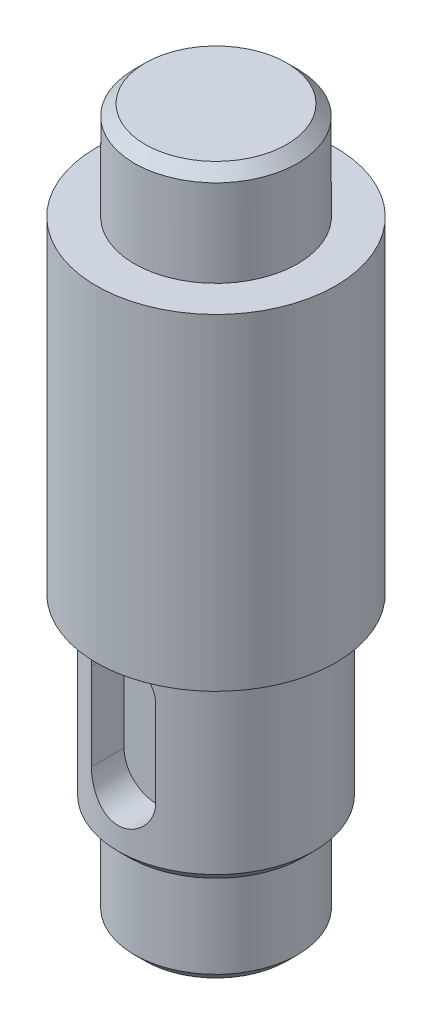
ISO-10303-21;
HEADER;
FILE_DESCRIPTION(('STEP AP214'),'2;1');
FILE_NAME('part.step','',(''),(''),'','','');
FILE_SCHEMA(('AUTOMOTIVE_DESIGN { 1 0 10303 214 1 1 1 1 }'));
ENDSEC;
DATA;
#1=APPLICATION_CONTEXT('core data for automotive mechanical design processes');
#2=APPLICATION_PROTOCOL_DEFINITION('international standard','automotive_design',2000,#1);
#3=PRODUCT_CONTEXT('',#1,'mechanical');
#4=PRODUCT('Part','Part','',(#3));
#5=PRODUCT_RELATED_PRODUCT_CATEGORY('part','',(#4));
#6=PRODUCT_DEFINITION_FORMATION('','',#4);
#7=PRODUCT_DEFINITION_CONTEXT('part definition',#1,'design');
#8=PRODUCT_DEFINITION('design','',#6,#7);
#9=PRODUCT_DEFINITION_SHAPE('','',#8);
#10=(LENGTH_UNIT() NAMED_UNIT(*) SI_UNIT(.MILLI.,.METRE.));
#11=(NAMED_UNIT(*) PLANE_ANGLE_UNIT() SI_UNIT($,.RADIAN.));
#12=(NAMED_UNIT(*) SI_UNIT($,.STERADIAN.) SOLID_ANGLE_UNIT());
#13=UNCERTAINTY_MEASURE_WITH_UNIT(LENGTH_MEASURE(1.E-05),#10,'distance_accuracy_value','');
#14=(GEOMETRIC_REPRESENTATION_CONTEXT(3) GLOBAL_UNCERTAINTY_ASSIGNED_CONTEXT((#13)) GLOBAL_UNIT_ASSIGNED_CONTEXT((#10,
#11,#12)) REPRESENTATION_CONTEXT('',''));
#15=CARTESIAN_POINT('',(0.,0.,0.));
#16=DIRECTION('',(0.,0.,1.));
#17=DIRECTION('',(1.,0.,0.));
#18=AXIS2_PLACEMENT_3D('',#15,#16,#17);
#19=CARTESIAN_POINT('',(0.,0.,0.));
#20=DIRECTION('',(0.,1.,0.));
#21=DIRECTION('',(-1.,0.,0.));
#22=AXIS2_PLACEMENT_3D('',#19,#20,#21);
#23=PLANE('',#22);
#24=CARTESIAN_POINT('',(0.,0.,0.));
#25=DIRECTION('',(0.,1.,0.));
#26=DIRECTION('',(-1.,0.,0.));
#27=AXIS2_PLACEMENT_3D('',#24,#25,#26);
#28=CIRCLE('',#27,6.5);
#29=CARTESIAN_POINT('',(-6.5,0.,0.));
#30=VERTEX_POINT('',#29);
#31=EDGE_CURVE('E161',#30,#30,#28,.T.);
#32=ORIENTED_EDGE('',*,*,#31,.T.);
#33=EDGE_LOOP('',(#32));
#34=FACE_BOUND('',#33,.T.);
#35=ADVANCED_FACE('F41',(#34),#23,.T.);
#36=CARTESIAN_POINT('',(0.,-65.,0.));
#37=DIRECTION('',(0.,-1.,0.));
#38=DIRECTION('',(1.,0.,0.));
#39=AXIS2_PLACEMENT_3D('',#36,#37,#38);
#40=CYLINDRICAL_SURFACE('',#39,7.5);
#41=CARTESIAN_POINT('',(0.,-1.,0.));
#42=DIRECTION('',(0.,1.,0.));
#43=DIRECTION('',(-1.,0.,0.));
#44=AXIS2_PLACEMENT_3D('',#41,#42,#43);
#45=CIRCLE('',#44,7.5);
#46=CARTESIAN_POINT('',(-7.5,-1.,0.));
#47=VERTEX_POINT('',#46);
#48=EDGE_CURVE('E157',#47,#47,#45,.F.);
#49=ORIENTED_EDGE('',*,*,#48,.T.);
#50=EDGE_LOOP('',(#49));
#51=FACE_BOUND('',#50,.T.);
#52=CARTESIAN_POINT('',(0.,-9.,0.));
#53=DIRECTION('',(0.,-1.,0.));
#54=DIRECTION('',(1.,0.,0.));
#55=AXIS2_PLACEMENT_3D('',#52,#53,#54);
#56=CIRCLE('',#55,7.5);
#57=CARTESIAN_POINT('',(7.5,-9.,0.));
#58=VERTEX_POINT('',#57);
#59=EDGE_CURVE('E137',#58,#58,#56,.T.);
#60=ORIENTED_EDGE('',*,*,#59,.F.);
#61=EDGE_LOOP('',(#60));
#62=FACE_BOUND('',#61,.T.);
#63=ADVANCED_FACE('F205',(#51,#62),#40,.T.);
#64=CARTESIAN_POINT('',(7.5,-9.,0.));
#65=DIRECTION('',(0.,1.,0.));
#66=DIRECTION('',(-1.,0.,0.));
#67=AXIS2_PLACEMENT_3D('',#64,#65,#66);
#68=PLANE('',#67);
#69=ORIENTED_EDGE('',*,*,#59,.T.);
#70=EDGE_LOOP('',(#69));
#71=FACE_BOUND('',#70,.T.);
#72=CARTESIAN_POINT('',(0.,-9.,0.));
#73=DIRECTION('',(0.,-1.,0.));
#74=DIRECTION('',(1.,0.,0.));
#75=AXIS2_PLACEMENT_3D('',#72,#73,#74);
#76=CIRCLE('',#75,11.);
#77=CARTESIAN_POINT('',(11.,-9.,0.));
#78=VERTEX_POINT('',#77);
#79=EDGE_CURVE('E133',#78,#78,#76,.T.);
#80=ORIENTED_EDGE('',*,*,#79,.F.);
#81=EDGE_LOOP('',(#80));
#82=FACE_BOUND('',#81,.T.);
#83=ADVANCED_FACE('F211',(#71,#82),#68,.T.);
#84=CARTESIAN_POINT('',(0.,-65.,0.));
#85=DIRECTION('',(0.,-1.,0.));
#86=DIRECTION('',(1.,0.,0.));
#87=AXIS2_PLACEMENT_3D('',#84,#85,#86);
#88=CYLINDRICAL_SURFACE('',#87,11.);
#89=ORIENTED_EDGE('',*,*,#79,.T.);
#90=EDGE_LOOP('',(#89));
#91=FACE_BOUND('',#90,.T.);
#92=CARTESIAN_POINT('',(0.,-39.,0.));
#93=DIRECTION('',(0.,-1.,0.));
#94=DIRECTION('',(1.,0.,0.));
#95=AXIS2_PLACEMENT_3D('',#92,#93,#94);
#96=CIRCLE('',#95,11.);
#97=CARTESIAN_POINT('',(11.,-39.,0.));
#98=VERTEX_POINT('',#97);
#99=EDGE_CURVE('E129',#98,#98,#96,.T.);
#100=ORIENTED_EDGE('',*,*,#99,.F.);
#101=EDGE_LOOP('',(#100));
#102=FACE_BOUND('',#101,.T.);
#103=ADVANCED_FACE('F239',(#91,#102),#88,.T.);
#104=CARTESIAN_POINT('',(11.,-39.,0.));
#105=DIRECTION('',(0.,-1.,0.));
#106=DIRECTION('',(1.,0.,0.));
#107=AXIS2_PLACEMENT_3D('',#104,#105,#106);
#108=PLANE('',#107);
#109=ORIENTED_EDGE('',*,*,#99,.T.);
#110=EDGE_LOOP('',(#109));
#111=FACE_BOUND('',#110,.T.);
#112=CARTESIAN_POINT('',(0.,-39.,0.));
#113=DIRECTION('',(0.,-1.,0.));
#114=DIRECTION('',(1.,0.,0.));
#115=AXIS2_PLACEMENT_3D('',#112,#113,#114);
#116=CIRCLE('',#115,9.);
#117=CARTESIAN_POINT('',(9.,-39.,0.));
#118=VERTEX_POINT('',#117);
#119=EDGE_CURVE('E125',#118,#118,#116,.T.);
#120=ORIENTED_EDGE('',*,*,#119,.F.);
#121=EDGE_LOOP('',(#120));
#122=FACE_BOUND('',#121,.T.);
#123=ADVANCED_FACE('F202',(#111,#122),#108,.T.);
#124=CARTESIAN_POINT('',(0.,-65.,0.));
#125=DIRECTION('',(0.,-1.,0.));
#126=DIRECTION('',(1.,0.,0.));
#127=AXIS2_PLACEMENT_3D('',#124,#125,#126);
#128=CYLINDRICAL_SURFACE('',#127,9.00000000000001);
#129=CARTESIAN_POINT('',(-2.95248976156616,-50.,8.50192944030042));
#130=CARTESIAN_POINT('',(-2.95250029693173,-50.0806317588222,8.50191684570187));
#131=CARTESIAN_POINT('',(-2.94918693631831,-50.1612564536216,8.50307620609258));
#132=CARTESIAN_POINT('',(-2.93599447837663,-50.3218821327495,8.50764511104681));
#133=CARTESIAN_POINT('',(-2.92611710372174,-50.4018832751524,8.51105406522067));
#134=CARTESIAN_POINT('',(-2.89991641303857,-50.5604662839918,8.52001558770745));
#135=CARTESIAN_POINT('',(-2.88361176101358,-50.6390515769994,8.5255619482266));
#136=CARTESIAN_POINT('',(-2.84472230473384,-50.7944657756751,8.53861657979725));
#137=CARTESIAN_POINT('',(-2.82213728407049,-50.8712946207208,8.54612491845394));
#138=CARTESIAN_POINT('',(-2.74525802634991,-51.0982742248879,8.57126010804136));
#139=CARTESIAN_POINT('',(-2.68180123672435,-51.2451474463141,8.59151109581029));
#140=CARTESIAN_POINT('',(-2.53245998637212,-51.5261813208311,8.63670645141518));
#141=CARTESIAN_POINT('',(-2.44656230202866,-51.6603344146668,8.66165358409112));
#142=CARTESIAN_POINT('',(-2.25129891120516,-51.9172221911251,8.7144826415037));
#143=CARTESIAN_POINT('',(-2.14123150905819,-52.0394099697384,8.7424357261372));
#144=CARTESIAN_POINT('',(-1.90225275848009,-52.2639629111186,8.79752536237442));
#145=CARTESIAN_POINT('',(-1.7733380922411,-52.3663245763734,8.82466176919667));
#146=CARTESIAN_POINT('',(-1.49631262163558,-52.5508070854321,8.87588610004537));
#147=CARTESIAN_POINT('',(-1.3478000780712,-52.6323531317914,8.89988001741487));
#148=CARTESIAN_POINT('',(-1.03825025385818,-52.7690862128327,8.94127364064229));
#149=CARTESIAN_POINT('',(-0.877216716758746,-52.8242810910637,8.95867530839543));
#150=CARTESIAN_POINT('',(-0.552963261906419,-52.9048899981395,8.98441853846128));
#151=CARTESIAN_POINT('',(-0.390000884496688,-52.9312469040592,8.99304625259565));
#152=CARTESIAN_POINT('',(-0.0617503209951023,-52.956427001969,9.00128398946526));
#153=CARTESIAN_POINT('',(0.103537321047814,-52.9552565309617,9.00089608766118));
#154=CARTESIAN_POINT('',(0.42507664206174,-52.9260178586799,8.99134123090442));
#155=CARTESIAN_POINT('',(0.581432985855349,-52.898973663452,8.98250850607949));
#156=CARTESIAN_POINT('',(0.88724877635239,-52.8204456296893,8.95747404366762));
#157=CARTESIAN_POINT('',(1.03670784259682,-52.7689604447349,8.94127190011191));
#158=CARTESIAN_POINT('',(1.32676059321678,-52.6423983902031,8.90288739691928));
#159=CARTESIAN_POINT('',(1.46721459354424,-52.5670249699099,8.88063039241782));
#160=CARTESIAN_POINT('',(1.73378676760048,-52.3950686872128,8.83246053792313));
#161=CARTESIAN_POINT('',(1.85990113409329,-52.2984802119819,8.80654672110387));
#162=CARTESIAN_POINT('',(2.10029975942743,-52.0816617849315,8.75240656023349));
#163=CARTESIAN_POINT('',(2.21378225082848,-51.9605545748121,8.7241286492635));
#164=CARTESIAN_POINT('',(2.41910145938373,-51.7007528004279,8.66944454819491));
#165=CARTESIAN_POINT('',(2.51093131879521,-51.5620526855357,8.64303895293599));
#166=CARTESIAN_POINT('',(2.67141670129289,-51.2685051590181,8.59480520018078));
#167=CARTESIAN_POINT('',(2.73973154762966,-51.1134597109222,8.57304593834259));
#168=CARTESIAN_POINT('',(2.84893761847341,-50.7932548456894,8.53738295090598));
#169=CARTESIAN_POINT('',(2.88987187283665,-50.6281117454361,8.52346690477813));
#170=CARTESIAN_POINT('',(2.92836991419632,-50.3844719724403,8.51027508043045));
#171=CARTESIAN_POINT('',(2.93741161312243,-50.3078412796298,8.50715397918366));
#172=CARTESIAN_POINT('',(2.94946732311459,-50.1541539488387,8.50297995415583));
#173=CARTESIAN_POINT('',(2.95248931746807,-50.0770980110774,8.50192429123895));
#174=CARTESIAN_POINT('',(2.95248976156616,-50.,8.50192944030042));
#175=B_SPLINE_CURVE_WITH_KNOTS('',3,(#129,#130,#131,#132,#133,#134,#135,#136,#137,#138,#139,
#140,#141,#142,#143,#144,#145,#146,#147,#148,#149,#150,#151,#152,#153,#154,#155,#156,#157,#158,
#159,#160,#161,#162,#163,#164,#165,#166,#167,#168,#169,#170,#171,#172,#173,#174),.UNSPECIFIED.,
.F.,.F.,(4,2,2,2,2,2,2,2,2,2,2,2,2,2,2,2,2,2,2,2,2,2,4),(0.,0.241806942767654,0.483550450271433,
0.724597076052257,0.965652008834216,1.44707166866517,1.928775654269,2.42694183379453,
2.92519581461805,3.43600040085354,3.94665284876179,4.44005815766278,4.93334988218077,
5.40789282630352,5.88246191535926,6.36316969371046,6.84400480553338,7.34676759275729,
7.84968939993589,8.35961767261461,8.8687426749101,9.10019480376127,9.33133977761773),.UNSPECIFIED.);
#176=CARTESIAN_POINT('',(-2.95248976156616,-50.,8.50192944030042));
#177=VERTEX_POINT('',#176);
#178=CARTESIAN_POINT('',(2.95248976156616,-50.,8.50192944030042));
#179=VERTEX_POINT('',#178);
#180=EDGE_CURVE('E165',#177,#179,#175,.T.);
#181=ORIENTED_EDGE('',*,*,#180,.F.);
#182=DIRECTION('',(0.,-1.,0.));
#183=VECTOR('',#182,1.);
#184=CARTESIAN_POINT('',(-2.95248976156616,-65.,8.50192944030042));
#185=LINE('',#184,#183);
#186=CARTESIAN_POINT('',(-2.95248976156616,-42.,8.50192944030042));
#187=VERTEX_POINT('',#186);
#188=EDGE_CURVE('E11',#187,#177,#185,.T.);
#189=ORIENTED_EDGE('',*,*,#188,.F.);
#190=CARTESIAN_POINT('',(2.95248976156616,-42.,8.50192944030042));
#191=CARTESIAN_POINT('',(2.95250029693173,-41.9193682411778,8.50191684570187));
#192=CARTESIAN_POINT('',(2.94918693631831,-41.8387435463784,8.50307620609258));
#193=CARTESIAN_POINT('',(2.93599447837663,-41.6781178672505,8.50764511104681));
#194=CARTESIAN_POINT('',(2.92611710372174,-41.5981167248476,8.51105406522067));
#195=CARTESIAN_POINT('',(2.89991641303857,-41.4395337160082,8.52001558770745));
#196=CARTESIAN_POINT('',(2.88361176101359,-41.3609484230006,8.5255619482266));
#197=CARTESIAN_POINT('',(2.84472230473385,-41.2055342243249,8.53861657979724));
#198=CARTESIAN_POINT('',(2.82213728407049,-41.1287053792792,8.54612491845394));
#199=CARTESIAN_POINT('',(2.74525802634992,-40.9017257751121,8.57126010804136));
#200=CARTESIAN_POINT('',(2.68180123672435,-40.7548525536859,8.59151109581029));
#201=CARTESIAN_POINT('',(2.53245998637212,-40.4738186791689,8.63670645141518));
#202=CARTESIAN_POINT('',(2.44656230202866,-40.3396655853333,8.66165358409112));
#203=CARTESIAN_POINT('',(2.25129891120516,-40.0827778088749,8.7144826415037));
#204=CARTESIAN_POINT('',(2.14123150905819,-39.9605900302616,8.7424357261372));
#205=CARTESIAN_POINT('',(1.90225275848009,-39.7360370888814,8.79752536237442));
#206=CARTESIAN_POINT('',(1.77333809224111,-39.6336754236266,8.82466176919667));
#207=CARTESIAN_POINT('',(1.49631262163558,-39.4491929145679,8.87588610004537));
#208=CARTESIAN_POINT('',(1.3478000780712,-39.3676468682086,8.89988001741487));
#209=CARTESIAN_POINT('',(1.03825025385819,-39.2309137871673,8.94127364064229));
#210=CARTESIAN_POINT('',(0.877216716758746,-39.1757189089363,8.95867530839543));
#211=CARTESIAN_POINT('',(0.552963261906418,-39.0951100018606,8.98441853846128));
#212=CARTESIAN_POINT('',(0.390000884496687,-39.0687530959408,8.99304625259565));
#213=CARTESIAN_POINT('',(0.0617503209951024,-39.043572998031,9.00128398946526));
#214=CARTESIAN_POINT('',(-0.103537321047813,-39.0447434690383,9.00089608766118));
#215=CARTESIAN_POINT('',(-0.425076642061738,-39.0739821413201,8.99134123090442));
#216=CARTESIAN_POINT('',(-0.581432985855346,-39.101026336548,8.98250850607949));
#217=CARTESIAN_POINT('',(-0.887248776352387,-39.1795543703108,8.95747404366762));
#218=CARTESIAN_POINT('',(-1.03670784259681,-39.2310395552651,8.94127190011192));
#219=CARTESIAN_POINT('',(-1.32676059321678,-39.3576016097969,8.90288739691928));
#220=CARTESIAN_POINT('',(-1.46721459354424,-39.4329750300901,8.88063039241782));
#221=CARTESIAN_POINT('',(-1.73378676760048,-39.6049313127872,8.83246053792313));
#222=CARTESIAN_POINT('',(-1.85990113409329,-39.7015197880181,8.80654672110387));
#223=CARTESIAN_POINT('',(-2.10029975942743,-39.9183382150685,8.75240656023349));
#224=CARTESIAN_POINT('',(-2.21378225082848,-40.0394454251879,8.7241286492635));
#225=CARTESIAN_POINT('',(-2.41910145938373,-40.2992471995721,8.66944454819491));
#226=CARTESIAN_POINT('',(-2.51093131879521,-40.4379473144643,8.64303895293599));
#227=CARTESIAN_POINT('',(-2.67141670129289,-40.7314948409819,8.59480520018078));
#228=CARTESIAN_POINT('',(-2.73973154762966,-40.8865402890778,8.57304593834259));
#229=CARTESIAN_POINT('',(-2.84893761847341,-41.2067451543106,8.53738295090598));
#230=CARTESIAN_POINT('',(-2.88987187283664,-41.3718882545639,8.52346690477813));
#231=CARTESIAN_POINT('',(-2.92836991419632,-41.6155280275598,8.51027508043045));
#232=CARTESIAN_POINT('',(-2.93741161312243,-41.6921587203702,8.50715397918366));
#233=CARTESIAN_POINT('',(-2.94946732311459,-41.8458460511613,8.50297995415583));
#234=CARTESIAN_POINT('',(-2.95248931746807,-41.9229019889226,8.50192429123895));
#235=CARTESIAN_POINT('',(-2.95248976156616,-42.,8.50192944030042));
#236=B_SPLINE_CURVE_WITH_KNOTS('',3,(#190,#191,#192,#193,#194,#195,#196,#197,#198,#199,#200,
#201,#202,#203,#204,#205,#206,#207,#208,#209,#210,#211,#212,#213,#214,#215,#216,#217,#218,#219,
#220,#221,#222,#223,#224,#225,#226,#227,#228,#229,#230,#231,#232,#233,#234,#235),.UNSPECIFIED.,
.F.,.F.,(4,2,2,2,2,2,2,2,2,2,2,2,2,2,2,2,2,2,2,2,2,2,4),(0.,0.241806942767661,0.483550450271433,
0.724597076052256,0.965652008834216,1.44707166866517,1.928775654269,2.42694183379453,
2.92519581461805,3.43600040085354,3.9466528487618,4.44005815766278,4.93334988218078,
5.40789282630352,5.88246191535926,6.36316969371046,6.84400480553338,7.3467675927573,
7.84968939993589,8.35961767261461,8.8687426749101,9.10019480376128,9.33133977761773),.UNSPECIFIED.);
#237=CARTESIAN_POINT('',(2.95248976156616,-42.,8.50192944030042));
#238=VERTEX_POINT('',#237);
#239=EDGE_CURVE('E51',#238,#187,#236,.T.);
#240=ORIENTED_EDGE('',*,*,#239,.F.);
#241=DIRECTION('',(0.,-1.,0.));
#242=VECTOR('',#241,1.);
#243=CARTESIAN_POINT('',(2.95248976156616,-65.,8.50192944030042));
#244=LINE('',#243,#242);
#245=EDGE_CURVE('E174',#238,#179,#244,.T.);
#246=ORIENTED_EDGE('',*,*,#245,.T.);
#247=EDGE_LOOP('',(#181,#189,#240,#246));
#248=FACE_BOUND('',#247,.T.);
#249=CARTESIAN_POINT('',(0.,-55.,0.));
#250=DIRECTION('',(0.,-1.,0.));
#251=DIRECTION('',(1.,0.,0.));
#252=AXIS2_PLACEMENT_3D('',#249,#250,#251);
#253=CIRCLE('',#252,9.00000000000001);
#254=CARTESIAN_POINT('',(9.00000000000001,-55.,0.));
#255=VERTEX_POINT('',#254);
#256=EDGE_CURVE('E153',#255,#255,#253,.F.);
#257=ORIENTED_EDGE('',*,*,#256,.T.);
#258=EDGE_LOOP('',(#257));
#259=FACE_BOUND('',#258,.T.);
#260=ORIENTED_EDGE('',*,*,#119,.T.);
#261=EDGE_LOOP('',(#260));
#262=FACE_BOUND('',#261,.T.);
#263=ADVANCED_FACE('F175',(#248,#259,#262),#128,.T.);
#264=CARTESIAN_POINT('',(9.00000000000001,-56.,0.));
#265=DIRECTION('',(0.,-1.,0.));
#266=DIRECTION('',(1.,0.,0.));
#267=AXIS2_PLACEMENT_3D('',#264,#265,#266);
#268=PLANE('',#267);
#269=CARTESIAN_POINT('',(0.,-56.,0.));
#270=DIRECTION('',(0.,-1.,0.));
#271=DIRECTION('',(1.,0.,0.));
#272=AXIS2_PLACEMENT_3D('',#269,#270,#271);
#273=CIRCLE('',#272,7.99999999999999);
#274=CARTESIAN_POINT('',(7.99999999999999,-56.,0.));
#275=VERTEX_POINT('',#274);
#276=EDGE_CURVE('E149',#275,#275,#273,.T.);
#277=ORIENTED_EDGE('',*,*,#276,.T.);
#278=EDGE_LOOP('',(#277));
#279=FACE_BOUND('',#278,.T.);
#280=CARTESIAN_POINT('',(0.,-56.,0.));
#281=DIRECTION('',(0.,-1.,0.));
#282=DIRECTION('',(1.,0.,0.));
#283=AXIS2_PLACEMENT_3D('',#280,#281,#282);
#284=CIRCLE('',#283,7.5);
#285=CARTESIAN_POINT('',(7.5,-56.,0.));
#286=VERTEX_POINT('',#285);
#287=EDGE_CURVE('E116',#286,#286,#284,.T.);
#288=ORIENTED_EDGE('',*,*,#287,.F.);
#289=EDGE_LOOP('',(#288));
#290=FACE_BOUND('',#289,.T.);
#291=ADVANCED_FACE('F195',(#279,#290),#268,.T.);
#292=CARTESIAN_POINT('',(0.,-65.,0.));
#293=DIRECTION('',(0.,-1.,0.));
#294=DIRECTION('',(1.,0.,0.));
#295=AXIS2_PLACEMENT_3D('',#292,#293,#294);
#296=CYLINDRICAL_SURFACE('',#295,7.5);
#297=CARTESIAN_POINT('',(0.,-64.,0.));
#298=DIRECTION('',(0.,-1.,0.));
#299=DIRECTION('',(1.,0.,0.));
#300=AXIS2_PLACEMENT_3D('',#297,#298,#299);
#301=CIRCLE('',#300,7.5);
#302=CARTESIAN_POINT('',(7.5,-64.,0.));
#303=VERTEX_POINT('',#302);
#304=EDGE_CURVE('E145',#303,#303,#301,.F.);
#305=ORIENTED_EDGE('',*,*,#304,.T.);
#306=EDGE_LOOP('',(#305));
#307=FACE_BOUND('',#306,.T.);
#308=ORIENTED_EDGE('',*,*,#287,.T.);
#309=EDGE_LOOP('',(#308));
#310=FACE_BOUND('',#309,.T.);
#311=ADVANCED_FACE('F192',(#307,#310),#296,.T.);
#312=CARTESIAN_POINT('',(7.5,-65.,0.));
#313=DIRECTION('',(0.,-1.,0.));
#314=DIRECTION('',(1.,0.,0.));
#315=AXIS2_PLACEMENT_3D('',#312,#313,#314);
#316=PLANE('',#315);
#317=CARTESIAN_POINT('',(0.,-65.,0.));
#318=DIRECTION('',(0.,-1.,0.));
#319=DIRECTION('',(1.,0.,0.));
#320=AXIS2_PLACEMENT_3D('',#317,#318,#319);
#321=CIRCLE('',#320,6.50000000000002);
#322=CARTESIAN_POINT('',(6.50000000000002,-65.,0.));
#323=VERTEX_POINT('',#322);
#324=EDGE_CURVE('E141',#323,#323,#321,.T.);
#325=ORIENTED_EDGE('',*,*,#324,.T.);
#326=EDGE_LOOP('',(#325));
#327=FACE_BOUND('',#326,.T.);
#328=ADVANCED_FACE('F188',(#327),#316,.T.);
#329=CARTESIAN_POINT('',(0.,-65.,0.));
#330=DIRECTION('',(0.,1.,0.));
#331=DIRECTION('',(-1.,0.,0.));
#332=AXIS2_PLACEMENT_3D('',#329,#330,#331);
#333=CONICAL_SURFACE('',#332,6.50000000000002,0.785398163397438);
#334=ORIENTED_EDGE('',*,*,#304,.F.);
#335=EDGE_LOOP('',(#334));
#336=FACE_BOUND('',#335,.T.);
#337=ORIENTED_EDGE('',*,*,#324,.F.);
#338=EDGE_LOOP('',(#337));
#339=FACE_BOUND('',#338,.T.);
#340=ADVANCED_FACE('F191',(#336,#339),#333,.T.);
#341=CARTESIAN_POINT('',(0.,-56.,0.));
#342=DIRECTION('',(0.,1.,0.));
#343=DIRECTION('',(-1.,0.,0.));
#344=AXIS2_PLACEMENT_3D('',#341,#342,#343);
#345=CONICAL_SURFACE('',#344,7.99999999999999,0.785398163397454);
#346=ORIENTED_EDGE('',*,*,#256,.F.);
#347=EDGE_LOOP('',(#346));
#348=FACE_BOUND('',#347,.T.);
#349=ORIENTED_EDGE('',*,*,#276,.F.);
#350=EDGE_LOOP('',(#349));
#351=FACE_BOUND('',#350,.T.);
#352=ADVANCED_FACE('F221',(#348,#351),#345,.T.);
#353=CARTESIAN_POINT('',(0.,-1.,0.));
#354=DIRECTION('',(0.,-1.,0.));
#355=DIRECTION('',(1.,0.,0.));
#356=AXIS2_PLACEMENT_3D('',#353,#354,#355);
#357=CONICAL_SURFACE('',#356,7.5,0.785398163397449);
#358=ORIENTED_EDGE('',*,*,#31,.F.);
#359=EDGE_LOOP('',(#358));
#360=FACE_BOUND('',#359,.T.);
#361=ORIENTED_EDGE('',*,*,#48,.F.);
#362=EDGE_LOOP('',(#361));
#363=FACE_BOUND('',#362,.T.);
#364=ADVANCED_FACE('F44',(#360,#363),#357,.T.);
#365=CARTESIAN_POINT('',(-2.95248976156616,0.,5.5));
#366=DIRECTION('',(-1.,0.,0.));
#367=DIRECTION('',(0.,-1.,0.));
#368=AXIS2_PLACEMENT_3D('',#365,#366,#367);
#369=PLANE('',#368);
#370=ORIENTED_EDGE('',*,*,#188,.T.);
#371=DIRECTION('',(0.,0.,1.));
#372=VECTOR('',#371,1.);
#373=CARTESIAN_POINT('',(-2.95248976156616,-50.,5.5));
#374=LINE('',#373,#372);
#375=CARTESIAN_POINT('',(-2.95248976156616,-50.,5.5));
#376=VERTEX_POINT('',#375);
#377=EDGE_CURVE('E83',#376,#177,#374,.T.);
#378=ORIENTED_EDGE('',*,*,#377,.F.);
#379=DIRECTION('',(0.,-1.,0.));
#380=VECTOR('',#379,1.);
#381=CARTESIAN_POINT('',(-2.95248976156616,0.,5.5));
#382=LINE('',#381,#380);
#383=CARTESIAN_POINT('',(-2.95248976156616,-42.,5.5));
#384=VERTEX_POINT('',#383);
#385=EDGE_CURVE('E87',#384,#376,#382,.T.);
#386=ORIENTED_EDGE('',*,*,#385,.F.);
#387=DIRECTION('',(0.,0.,1.));
#388=VECTOR('',#387,1.);
#389=CARTESIAN_POINT('',(-2.95248976156616,-42.,5.5));
#390=LINE('',#389,#388);
#391=EDGE_CURVE('E113',#384,#187,#390,.T.);
#392=ORIENTED_EDGE('',*,*,#391,.T.);
#393=EDGE_LOOP('',(#370,#378,#386,#392));
#394=FACE_BOUND('',#393,.T.);
#395=ADVANCED_FACE('F85',(#394),#369,.F.);
#396=CARTESIAN_POINT('',(0.,-42.,5.5));
#397=DIRECTION('',(0.,0.,1.));
#398=DIRECTION('',(1.,0.,0.));
#399=AXIS2_PLACEMENT_3D('',#396,#397,#398);
#400=CYLINDRICAL_SURFACE('',#399,2.95248976156616);
#401=DIRECTION('',(0.,0.,1.));
#402=VECTOR('',#401,1.);
#403=CARTESIAN_POINT('',(2.95248976156616,-42.,5.5));
#404=LINE('',#403,#402);
#405=CARTESIAN_POINT('',(2.95248976156616,-42.,5.5));
#406=VERTEX_POINT('',#405);
#407=EDGE_CURVE('E117',#406,#238,#404,.T.);
#408=ORIENTED_EDGE('',*,*,#407,.T.);
#409=ORIENTED_EDGE('',*,*,#239,.T.);
#410=ORIENTED_EDGE('',*,*,#391,.F.);
#411=CARTESIAN_POINT('',(0.,-42.,5.5));
#412=DIRECTION('',(0.,0.,1.));
#413=DIRECTION('',(1.,0.,0.));
#414=AXIS2_PLACEMENT_3D('',#411,#412,#413);
#415=CIRCLE('',#414,2.95248976156616);
#416=EDGE_CURVE('E92',#406,#384,#415,.T.);
#417=ORIENTED_EDGE('',*,*,#416,.F.);
#418=EDGE_LOOP('',(#408,#409,#410,#417));
#419=FACE_BOUND('',#418,.T.);
#420=ADVANCED_FACE('F187',(#419),#400,.F.);
#421=CARTESIAN_POINT('',(2.95248976156616,0.,5.5));
#422=DIRECTION('',(-1.,0.,0.));
#423=DIRECTION('',(0.,0.,1.));
#424=AXIS2_PLACEMENT_3D('',#421,#422,#423);
#425=PLANE('',#424);
#426=ORIENTED_EDGE('',*,*,#407,.F.);
#427=DIRECTION('',(0.,-1.,0.));
#428=VECTOR('',#427,1.);
#429=CARTESIAN_POINT('',(2.95248976156616,0.,5.5));
#430=LINE('',#429,#428);
#431=CARTESIAN_POINT('',(2.95248976156616,-50.,5.5));
#432=VERTEX_POINT('',#431);
#433=EDGE_CURVE('E102',#406,#432,#430,.T.);
#434=ORIENTED_EDGE('',*,*,#433,.T.);
#435=DIRECTION('',(0.,0.,1.));
#436=VECTOR('',#435,1.);
#437=CARTESIAN_POINT('',(2.95248976156616,-50.,5.5));
#438=LINE('',#437,#436);
#439=EDGE_CURVE('E91',#432,#179,#438,.T.);
#440=ORIENTED_EDGE('',*,*,#439,.T.);
#441=ORIENTED_EDGE('',*,*,#245,.F.);
#442=EDGE_LOOP('',(#426,#434,#440,#441));
#443=FACE_BOUND('',#442,.T.);
#444=ADVANCED_FACE('F183',(#443),#425,.T.);
#445=CARTESIAN_POINT('',(0.,-50.,5.5));
#446=DIRECTION('',(0.,0.,1.));
#447=DIRECTION('',(1.,0.,0.));
#448=AXIS2_PLACEMENT_3D('',#445,#446,#447);
#449=CYLINDRICAL_SURFACE('',#448,2.95248976156616);
#450=ORIENTED_EDGE('',*,*,#377,.T.);
#451=ORIENTED_EDGE('',*,*,#180,.T.);
#452=ORIENTED_EDGE('',*,*,#439,.F.);
#453=CARTESIAN_POINT('',(0.,-50.,5.5));
#454=DIRECTION('',(0.,0.,1.));
#455=DIRECTION('',(1.,0.,0.));
#456=AXIS2_PLACEMENT_3D('',#453,#454,#455);
#457=CIRCLE('',#456,2.95248976156616);
#458=EDGE_CURVE('E96',#376,#432,#457,.T.);
#459=ORIENTED_EDGE('',*,*,#458,.F.);
#460=EDGE_LOOP('',(#450,#451,#452,#459));
#461=FACE_BOUND('',#460,.T.);
#462=ADVANCED_FACE('F97',(#461),#449,.F.);
#463=CARTESIAN_POINT('',(0.,0.,5.5));
#464=DIRECTION('',(0.,0.,1.));
#465=DIRECTION('',(1.,0.,0.));
#466=AXIS2_PLACEMENT_3D('',#463,#464,#465);
#467=PLANE('',#466);
#468=ORIENTED_EDGE('',*,*,#385,.T.);
#469=ORIENTED_EDGE('',*,*,#458,.T.);
#470=ORIENTED_EDGE('',*,*,#433,.F.);
#471=ORIENTED_EDGE('',*,*,#416,.T.);
#472=EDGE_LOOP('',(#468,#469,#470,#471));
#473=FACE_BOUND('',#472,.T.);
#474=ADVANCED_FACE('F104',(#473),#467,.T.);
#475=CLOSED_SHELL('',(#35,#63,#83,#103,#123,#263,#291,#311,#328,#340,#352,#364,#395,#420,#444,
#462,#474));
#476=MANIFOLD_SOLID_BREP('B2',#475);
#477=ADVANCED_BREP_SHAPE_REPRESENTATION('',(#18,#476),#14);
#478=SHAPE_DEFINITION_REPRESENTATION(#9,#477);
ENDSEC;
END-ISO-10303-21;
